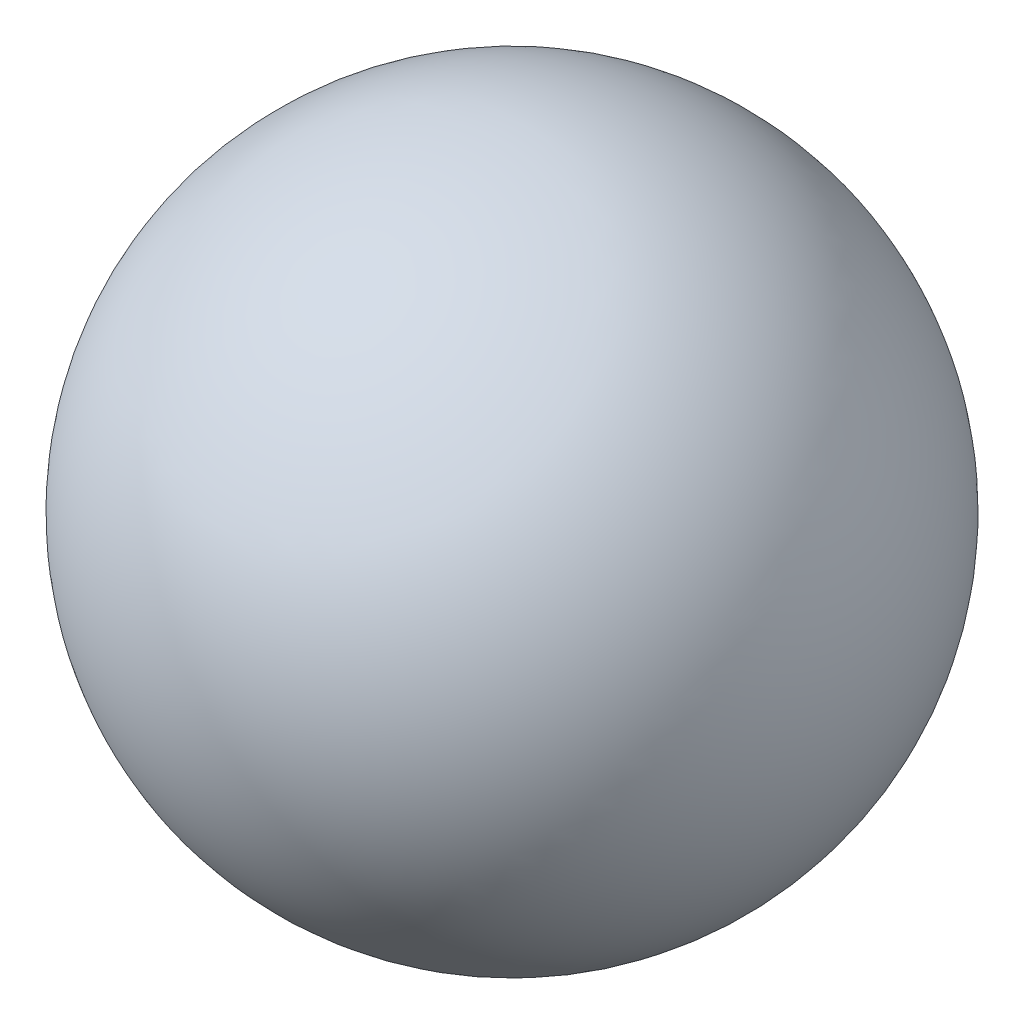
ISO-10303-21;
HEADER;
FILE_DESCRIPTION(('STEP AP214'),'2;1');
FILE_NAME('part.step','',(''),(''),'','','');
FILE_SCHEMA(('AUTOMOTIVE_DESIGN { 1 0 10303 214 1 1 1 1 }'));
ENDSEC;
DATA;
#1=APPLICATION_CONTEXT('core data for automotive mechanical design processes');
#2=APPLICATION_PROTOCOL_DEFINITION('international standard','automotive_design',2000,#1);
#3=PRODUCT_CONTEXT('',#1,'mechanical');
#4=PRODUCT('Part','Part','',(#3));
#5=PRODUCT_RELATED_PRODUCT_CATEGORY('part','',(#4));
#6=PRODUCT_DEFINITION_FORMATION('','',#4);
#7=PRODUCT_DEFINITION_CONTEXT('part definition',#1,'design');
#8=PRODUCT_DEFINITION('design','',#6,#7);
#9=PRODUCT_DEFINITION_SHAPE('','',#8);
#10=(LENGTH_UNIT() NAMED_UNIT(*) SI_UNIT(.MILLI.,.METRE.));
#11=(NAMED_UNIT(*) PLANE_ANGLE_UNIT() SI_UNIT($,.RADIAN.));
#12=(NAMED_UNIT(*) SI_UNIT($,.STERADIAN.) SOLID_ANGLE_UNIT());
#13=UNCERTAINTY_MEASURE_WITH_UNIT(LENGTH_MEASURE(1.E-05),#10,'distance_accuracy_value','');
#14=(GEOMETRIC_REPRESENTATION_CONTEXT(3) GLOBAL_UNCERTAINTY_ASSIGNED_CONTEXT((#13)) GLOBAL_UNIT_ASSIGNED_CONTEXT((#10,
#11,#12)) REPRESENTATION_CONTEXT('',''));
#15=CARTESIAN_POINT('',(0.,0.,0.));
#16=DIRECTION('',(0.,0.,1.));
#17=DIRECTION('',(1.,0.,0.));
#18=AXIS2_PLACEMENT_3D('',#15,#16,#17);
#19=CARTESIAN_POINT('',(3.31035754288681,-2.,-11.2740424399703));
#20=DIRECTION('',(0.,0.,1.));
#21=DIRECTION('',(1.,0.,0.));
#22=AXIS2_PLACEMENT_3D('',#19,#20,#21);
#23=SPHERICAL_SURFACE('',#22,1.05);
#24=CARTESIAN_POINT('',(3.31035754288681,-2.,-10.2240424399703));
#25=VERTEX_POINT('',#24);
#26=VERTEX_LOOP('',#25);
#27=FACE_BOUND('',#26,.T.);
#28=ADVANCED_FACE('F13',(#27),#23,.T.);
#29=CLOSED_SHELL('',(#28));
#30=MANIFOLD_SOLID_BREP('B1',#29);
#31=ADVANCED_BREP_SHAPE_REPRESENTATION('',(#18,#30),#14);
#32=SHAPE_DEFINITION_REPRESENTATION(#9,#31);
ENDSEC;
END-ISO-10303-21;
